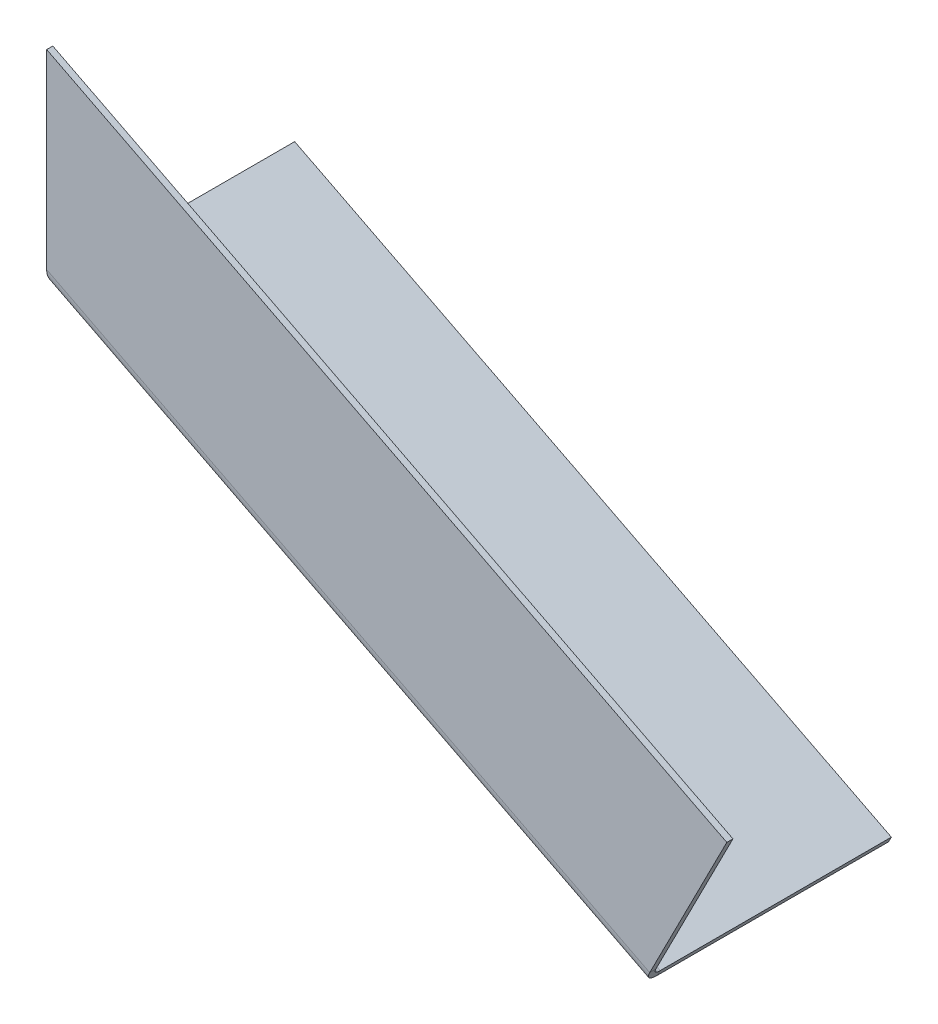
ISO-10303-21;
HEADER;
FILE_DESCRIPTION(('STEP AP214'),'2;1');
FILE_NAME('part.step','',(''),(''),'','','');
FILE_SCHEMA(('AUTOMOTIVE_DESIGN { 1 0 10303 214 1 1 1 1 }'));
ENDSEC;
DATA;
#1=APPLICATION_CONTEXT('core data for automotive mechanical design processes');
#2=APPLICATION_PROTOCOL_DEFINITION('international standard','automotive_design',2000,#1);
#3=PRODUCT_CONTEXT('',#1,'mechanical');
#4=PRODUCT('Part','Part','',(#3));
#5=PRODUCT_RELATED_PRODUCT_CATEGORY('part','',(#4));
#6=PRODUCT_DEFINITION_FORMATION('','',#4);
#7=PRODUCT_DEFINITION_CONTEXT('part definition',#1,'design');
#8=PRODUCT_DEFINITION('design','',#6,#7);
#9=PRODUCT_DEFINITION_SHAPE('','',#8);
#10=(LENGTH_UNIT() NAMED_UNIT(*) SI_UNIT(.MILLI.,.METRE.));
#11=(NAMED_UNIT(*) PLANE_ANGLE_UNIT() SI_UNIT($,.RADIAN.));
#12=(NAMED_UNIT(*) SI_UNIT($,.STERADIAN.) SOLID_ANGLE_UNIT());
#13=UNCERTAINTY_MEASURE_WITH_UNIT(LENGTH_MEASURE(1.E-05),#10,'distance_accuracy_value','');
#14=(GEOMETRIC_REPRESENTATION_CONTEXT(3) GLOBAL_UNCERTAINTY_ASSIGNED_CONTEXT((#13)) GLOBAL_UNIT_ASSIGNED_CONTEXT((#10,
#11,#12)) REPRESENTATION_CONTEXT('',''));
#15=CARTESIAN_POINT('',(0.,0.,0.));
#16=DIRECTION('',(0.,0.,1.));
#17=DIRECTION('',(1.,0.,0.));
#18=AXIS2_PLACEMENT_3D('',#15,#16,#17);
#19=CARTESIAN_POINT('',(-0.00293144740752917,-31.9798217250515,39.9296640146386));
#20=CARTESIAN_POINT('',(-0.0071534650994764,-32.3573127301977,39.8698220839962));
#21=CARTESIAN_POINT('',(-0.0130730410045433,-32.7261659165773,39.7724728086325));
#22=CARTESIAN_POINT('',(-0.0239778487713968,-33.4431791943966,39.4999996285628));
#23=CARTESIAN_POINT('',(-0.0286594285825225,-33.7931858406784,39.3239775521161));
#24=CARTESIAN_POINT('',(-0.0321544801784738,-34.2921472334461,38.9956954327784));
#25=CARTESIAN_POINT('',(-0.0327328344029795,-34.4528182206478,38.8764184467605));
#26=CARTESIAN_POINT('',(-0.0322522901227189,-34.7619126095619,38.6169162821423));
#27=CARTESIAN_POINT('',(-0.0312345487248001,-34.910988793869,38.4759094920383));
#28=CARTESIAN_POINT('',(-0.0268555426421286,-35.3298746803564,38.0255094120973));
#29=CARTESIAN_POINT('',(-0.0212717875252789,-35.5748568140411,37.6889598912189));
#30=CARTESIAN_POINT('',(-0.0206939389701947,-35.7731444830034,37.2999864592261));
#31=CARTESIAN_POINT('',(0.155242558766089,-31.6693877588373,37.9602448778392));
#32=CARTESIAN_POINT('',(0.217791935777052,-31.9158471511565,37.9264198378169));
#33=CARTESIAN_POINT('',(0.277271758439338,-32.1563321629699,37.8713976744445));
#34=CARTESIAN_POINT('',(0.393447613613939,-32.6239355966537,37.7173910944052));
#35=CARTESIAN_POINT('',(0.450742368852166,-32.852306836675,37.617900355544));
#36=CARTESIAN_POINT('',(0.535314482060101,-33.1784266866085,37.43234959244));
#37=CARTESIAN_POINT('',(0.563045685507329,-33.2835370385175,37.3649321655604));
#38=CARTESIAN_POINT('',(0.617844605017635,-33.4860256135632,37.218257029037));
#39=CARTESIAN_POINT('',(0.644989659143247,-33.5838240594303,37.1385575389782));
#40=CARTESIAN_POINT('',(0.722647080439956,-33.8588929583919,36.8839835807508));
#41=CARTESIAN_POINT('',(0.770789035060009,-34.0201964899942,36.693929091892));
#42=CARTESIAN_POINT('',(0.806215836183954,-34.1502426711809,36.4739053899975));
#43=B_SPLINE_SURFACE_WITH_KNOTS('',1,3,((#19,#20,#21,#22,#23,#24,#25,#26,#27,#28,#29,#30),(#31,
#32,#33,#34,#35,#36,#37,#38,#39,#40,#41,#42)),.UNSPECIFIED.,.F.,.F.,.F.,(2,2),(4,2,2,2,2,4),(0.,
1.),(0.,0.000758718306355654,0.00151743661271129,0.00189679576588911,0.00227615491906693,
0.00303487322542257),.UNSPECIFIED.);
#44=CARTESIAN_POINT('',(-0.0206939389700522,-35.7731444830034,37.2999864592262));
#45=CARTESIAN_POINT('',(0.806215836184088,-34.150242671181,36.4739053899975));
#46=B_SPLINE_CURVE_WITH_KNOTS('',1,(#44,#45),.UNSPECIFIED.,.F.,.F.,(2,2),(0.,1.),.UNSPECIFIED.);
#47=CARTESIAN_POINT('',(-0.0206939389701542,-35.7731444830034,37.2999864592261));
#48=VERTEX_POINT('',#47);
#49=CARTESIAN_POINT('',(0.806215836183954,-34.1502426711811,36.4739053899975));
#50=VERTEX_POINT('',#49);
#51=EDGE_CURVE('E11',#48,#50,#46,.T.);
#52=CARTESIAN_POINT('',(-0.0206939389701947,-35.7731444830034,37.2999864592261));
#53=CARTESIAN_POINT('',(-0.0212717875252789,-35.5748568140411,37.6889598912189));
#54=CARTESIAN_POINT('',(-0.0268555426421286,-35.3298746803564,38.0255094120973));
#55=CARTESIAN_POINT('',(-0.0312345487248001,-34.910988793869,38.4759094920383));
#56=CARTESIAN_POINT('',(-0.0322522901227189,-34.7619126095619,38.6169162821423));
#57=CARTESIAN_POINT('',(-0.0327328344029795,-34.4528182206478,38.8764184467605));
#58=CARTESIAN_POINT('',(-0.0321544801784738,-34.2921472334461,38.9956954327784));
#59=CARTESIAN_POINT('',(-0.0286594285825225,-33.7931858406784,39.3239775521161));
#60=CARTESIAN_POINT('',(-0.0239778487713968,-33.4431791943966,39.4999996285628));
#61=CARTESIAN_POINT('',(-0.0130730410045433,-32.7261659165773,39.7724728086325));
#62=CARTESIAN_POINT('',(-0.0071534650994764,-32.3573127301977,39.8698220839962));
#63=CARTESIAN_POINT('',(-0.00293144740752917,-31.9798217250515,39.9296640146386));
#64=B_SPLINE_CURVE_WITH_KNOTS('',3,(#52,#53,#54,#55,#56,#57,#58,#59,#60,#61,#62,#63),
.UNSPECIFIED.,.F.,.F.,(4,2,2,2,2,4),(0.,0.000758718306355655,0.00113807745953347,
0.00151743661271129,0.00227615491906693,0.00303487322542257),.UNSPECIFIED.);
#65=CARTESIAN_POINT('',(-0.00293144740757867,-31.9798217250515,39.9296640146387));
#66=VERTEX_POINT('',#65);
#67=EDGE_CURVE('E132',#66,#48,#64,.F.);
#68=CARTESIAN_POINT('',(-0.00293144740752917,-31.9798217250515,39.9296640146386));
#69=CARTESIAN_POINT('',(0.155242558766089,-31.6693877588373,37.9602448778392));
#70=B_SPLINE_CURVE_WITH_KNOTS('',1,(#68,#69),.UNSPECIFIED.,.F.,.F.,(2,2),(0.,1.),.UNSPECIFIED.);
#71=CARTESIAN_POINT('',(0.155241708459652,-31.6693879608942,37.9602447776971));
#72=VERTEX_POINT('',#71);
#73=EDGE_CURVE('E59',#66,#72,#70,.T.);
#74=CARTESIAN_POINT('',(0.155242558766089,-31.6693877588373,37.9602448778392));
#75=CARTESIAN_POINT('',(0.217791935777052,-31.9158471511565,37.9264198378169));
#76=CARTESIAN_POINT('',(0.277271758439338,-32.1563321629699,37.8713976744445));
#77=CARTESIAN_POINT('',(0.393447613613939,-32.6239355966537,37.7173910944052));
#78=CARTESIAN_POINT('',(0.450742368852166,-32.852306836675,37.617900355544));
#79=CARTESIAN_POINT('',(0.535314482060101,-33.1784266866085,37.43234959244));
#80=CARTESIAN_POINT('',(0.563045685507329,-33.2835370385175,37.3649321655604));
#81=CARTESIAN_POINT('',(0.617844605017635,-33.4860256135632,37.218257029037));
#82=CARTESIAN_POINT('',(0.644989659143247,-33.5838240594303,37.1385575389782));
#83=CARTESIAN_POINT('',(0.722647080439956,-33.8588929583919,36.8839835807508));
#84=CARTESIAN_POINT('',(0.770789035060009,-34.0201964899942,36.693929091892));
#85=CARTESIAN_POINT('',(0.806215836183954,-34.1502426711809,36.4739053899975));
#86=B_SPLINE_CURVE_WITH_KNOTS('',3,(#74,#75,#76,#77,#78,#79,#80,#81,#82,#83,#84,#85),
.UNSPECIFIED.,.F.,.F.,(4,2,2,2,2,4),(0.,0.000758718306355654,0.00151743661271129,
0.00189679576588911,0.00227615491906693,0.00303487322542257),.UNSPECIFIED.);
#87=EDGE_CURVE('E261',#72,#50,#86,.T.);
#88=ORIENTED_EDGE('',*,*,#51,.F.);
#89=ORIENTED_EDGE('',*,*,#67,.F.);
#90=ORIENTED_EDGE('',*,*,#73,.T.);
#91=ORIENTED_EDGE('',*,*,#87,.T.);
#92=EDGE_LOOP('',(#88,#89,#90,#91));
#93=FACE_BOUND('',#92,.T.);
#94=ADVANCED_FACE('F45',(#93),#43,.T.);
#95=CARTESIAN_POINT('',(0.,-31.0819517821508,40.0000000000002));
#96=CARTESIAN_POINT('',(-0.00159941509093738,-31.382469139948,40.0000000000002));
#97=CARTESIAN_POINT('',(-0.00319685827762162,-31.6829628275133,39.9764357865138));
#98=CARTESIAN_POINT('',(-0.00293249539698418,-31.9798223150835,39.9296638374642));
#99=CARTESIAN_POINT('',(0.,-31.0819517821508,38.0000000000002));
#100=CARTESIAN_POINT('',(0.0513965444831389,-31.2784567784155,38.0000000000002));
#101=CARTESIAN_POINT('',(0.102791731106516,-31.4749504430474,37.9866809247502));
#102=CARTESIAN_POINT('',(0.155241708459797,-31.6693879608942,37.9602447776973));
#103=B_SPLINE_SURFACE_WITH_KNOTS('',1,3,((#95,#96,#97,#98),(#99,#100,#101,#102)),.UNSPECIFIED.,
.F.,.F.,.F.,(2,2),(4,4),(0.,1.),(0.,1.),.UNSPECIFIED.);
#104=CARTESIAN_POINT('',(-0.00293249539698418,-31.9798223150835,39.9296638374642));
#105=CARTESIAN_POINT('',(-0.00319685827762162,-31.6829628275133,39.9764357865138));
#106=CARTESIAN_POINT('',(-0.00159941509093738,-31.382469139948,40.0000000000002));
#107=CARTESIAN_POINT('',(0.,-31.0819517821508,40.0000000000002));
#108=B_SPLINE_CURVE_WITH_KNOTS('',3,(#104,#105,#106,#107),.UNSPECIFIED.,.F.,.F.,(4,4),(0.,1.),.UNSPECIFIED.);
#109=CARTESIAN_POINT('',(-1.14048567911002E-13,-31.0819517821509,40.0000000000002));
#110=VERTEX_POINT('',#109);
#111=EDGE_CURVE('E301',#110,#66,#108,.F.);
#112=CARTESIAN_POINT('',(0.,-31.0819517821508,40.0000000000002));
#113=CARTESIAN_POINT('',(0.,-31.0819517821508,38.0000000000002));
#114=B_SPLINE_CURVE_WITH_KNOTS('',1,(#112,#113),.UNSPECIFIED.,.F.,.F.,(2,2),(0.,1.),.UNSPECIFIED.);
#115=CARTESIAN_POINT('',(-1.11022302462516E-13,-31.0819517821509,38.0000000000001));
#116=VERTEX_POINT('',#115);
#117=EDGE_CURVE('E207',#110,#116,#114,.T.);
#118=CARTESIAN_POINT('',(0.,-31.0819517821508,38.0000000000002));
#119=CARTESIAN_POINT('',(0.0513965444831389,-31.2784567784155,38.0000000000002));
#120=CARTESIAN_POINT('',(0.102791731106516,-31.4749504430474,37.9866809247502));
#121=CARTESIAN_POINT('',(0.155241708459797,-31.6693879608942,37.9602447776973));
#122=B_SPLINE_CURVE_WITH_KNOTS('',3,(#118,#119,#120,#121),.UNSPECIFIED.,.F.,.F.,(4,4),(0.,1.),.UNSPECIFIED.);
#123=EDGE_CURVE('E346',#116,#72,#122,.T.);
#124=ORIENTED_EDGE('',*,*,#73,.F.);
#125=ORIENTED_EDGE('',*,*,#111,.F.);
#126=ORIENTED_EDGE('',*,*,#117,.T.);
#127=ORIENTED_EDGE('',*,*,#123,.T.);
#128=EDGE_LOOP('',(#124,#125,#126,#127));
#129=FACE_BOUND('',#128,.T.);
#130=ADVANCED_FACE('F219',(#129),#103,.T.);
#131=CARTESIAN_POINT('',(-1.11022302462516E-13,-3.33066907387547E-13,38.0000000000001));
#132=DIRECTION('',(1.,0.,0.));
#133=DIRECTION('',(0.,-1.,0.));
#134=AXIS2_PLACEMENT_3D('',#131,#132,#133);
#135=PLANE('',#134);
#136=ORIENTED_EDGE('',*,*,#117,.F.);
#137=DIRECTION('',(0.,1.,0.));
#138=VECTOR('',#137,1.);
#139=CARTESIAN_POINT('',(-1.6955971914226E-13,-2.35809509567117E-13,40.0000000000004));
#140=LINE('',#139,#138);
#141=CARTESIAN_POINT('',(-1.6955971914226E-13,31.0949217827926,40.0000000000006));
#142=VERTEX_POINT('',#141);
#143=EDGE_CURVE('E385',#142,#110,#140,.F.);
#144=ORIENTED_EDGE('',*,*,#143,.F.);
#145=DIRECTION('',(0.,0.,-1.));
#146=VECTOR('',#145,1.);
#147=CARTESIAN_POINT('',(-1.66533453693773E-13,31.0949217827926,38.0000000000006));
#148=LINE('',#147,#146);
#149=CARTESIAN_POINT('',(-1.66533453693773E-13,31.0949217827926,38.0000000000006));
#150=VERTEX_POINT('',#149);
#151=EDGE_CURVE('E204',#142,#150,#148,.T.);
#152=ORIENTED_EDGE('',*,*,#151,.T.);
#153=DIRECTION('',(0.,-1.,0.));
#154=VECTOR('',#153,1.);
#155=CARTESIAN_POINT('',(-1.11022302462516E-13,-3.33066907387547E-13,38.0000000000001));
#156=LINE('',#155,#154);
#157=EDGE_CURVE('E433',#150,#116,#156,.T.);
#158=ORIENTED_EDGE('',*,*,#157,.T.);
#159=EDGE_LOOP('',(#136,#144,#152,#158));
#160=FACE_BOUND('',#159,.T.);
#161=ADVANCED_FACE('F230',(#160),#135,.F.);
#162=CARTESIAN_POINT('',(-0.891006524188331,31.5489122825321,38.0000000000006));
#163=DIRECTION('',(0.453990499739545,0.891006524188369,0.));
#164=DIRECTION('',(0.891006524188369,-0.453990499739545,0.));
#165=AXIS2_PLACEMENT_3D('',#162,#163,#164);
#166=PLANE('',#165);
#167=ORIENTED_EDGE('',*,*,#151,.F.);
#168=DIRECTION('',(0.891006524188369,-0.453990499739545,0.));
#169=VECTOR('',#168,1.);
#170=CARTESIAN_POINT('',(-0.891006524188334,31.5489122825321,40.0000000000006));
#171=LINE('',#170,#169);
#172=CARTESIAN_POINT('',(221.860624522904,-81.9487126523542,40.0000000000002));
#173=VERTEX_POINT('',#172);
#174=EDGE_CURVE('E376',#173,#142,#171,.F.);
#175=ORIENTED_EDGE('',*,*,#174,.F.);
#176=DIRECTION('',(0.,0.,-1.));
#177=VECTOR('',#176,1.);
#178=CARTESIAN_POINT('',(221.860624522904,-81.9487126523541,38.0000000000002));
#179=LINE('',#178,#177);
#180=CARTESIAN_POINT('',(221.860624522904,-81.9487126523541,38.0000000000002));
#181=VERTEX_POINT('',#180);
#182=EDGE_CURVE('E201',#173,#181,#179,.T.);
#183=ORIENTED_EDGE('',*,*,#182,.T.);
#184=DIRECTION('',(0.891006524188369,-0.453990499739545,0.));
#185=VECTOR('',#184,1.);
#186=CARTESIAN_POINT('',(-0.891006524188331,31.5489122825321,38.0000000000006));
#187=LINE('',#186,#185);
#188=EDGE_CURVE('E426',#181,#150,#187,.F.);
#189=ORIENTED_EDGE('',*,*,#188,.T.);
#190=EDGE_LOOP('',(#167,#175,#183,#189));
#191=FACE_BOUND('',#190,.T.);
#192=ADVANCED_FACE('F424',(#191),#166,.T.);
#193=CARTESIAN_POINT('',(221.860624522904,-81.9487126523541,38.0000000000002));
#194=DIRECTION('',(0.891006524188369,-0.453990499739544,0.));
#195=DIRECTION('',(-0.453990499739544,-0.891006524188369,0.));
#196=AXIS2_PLACEMENT_3D('',#193,#194,#195);
#197=PLANE('',#196);
#198=ORIENTED_EDGE('',*,*,#182,.F.);
#199=DIRECTION('',(-0.453990499739544,-0.891006524188369,0.));
#200=VECTOR('',#199,1.);
#201=CARTESIAN_POINT('',(221.860624522904,-81.9487126523542,40.0000000000002));
#202=LINE('',#201,#200);
#203=CARTESIAN_POINT('',(196.709550837333,-131.31047409239,39.9999999999999));
#204=VERTEX_POINT('',#203);
#205=EDGE_CURVE('E369',#204,#173,#202,.F.);
#206=ORIENTED_EDGE('',*,*,#205,.F.);
#207=DIRECTION('',(0.,0.,-1.));
#208=VECTOR('',#207,1.);
#209=CARTESIAN_POINT('',(196.709550837333,-131.31047409239,38.));
#210=LINE('',#209,#208);
#211=CARTESIAN_POINT('',(196.709550837333,-131.31047409239,38.));
#212=VERTEX_POINT('',#211);
#213=EDGE_CURVE('E198',#204,#212,#210,.T.);
#214=ORIENTED_EDGE('',*,*,#213,.T.);
#215=DIRECTION('',(-0.453990499739544,-0.891006524188369,0.));
#216=VECTOR('',#215,1.);
#217=CARTESIAN_POINT('',(221.860624522904,-81.9487126523541,38.0000000000002));
#218=LINE('',#217,#216);
#219=EDGE_CURVE('E420',#212,#181,#218,.F.);
#220=ORIENTED_EDGE('',*,*,#219,.T.);
#221=EDGE_LOOP('',(#198,#206,#214,#220));
#222=FACE_BOUND('',#221,.T.);
#223=ADVANCED_FACE('F418',(#222),#197,.T.);
#224=CARTESIAN_POINT('',(196.709550837333,-131.31047409239,35.3999999999999));
#225=DIRECTION('',(-0.891006524188369,0.453990499739546,0.));
#226=DIRECTION('',(-0.453990499739546,-0.891006524188369,0.));
#227=AXIS2_PLACEMENT_3D('',#224,#225,#226);
#228=PLANE('',#227);
#229=ORIENTED_EDGE('',*,*,#213,.F.);
#230=CARTESIAN_POINT('',(196.709550837333,-131.31047409239,35.3999999999999));
#231=DIRECTION('',(0.891006524188369,-0.453990499739546,0.));
#232=DIRECTION('',(0.453990499739546,0.891006524188369,0.));
#233=AXIS2_PLACEMENT_3D('',#230,#231,#232);
#234=CIRCLE('',#233,4.60000000000005);
#235=CARTESIAN_POINT('',(194.621194538531,-135.409104103656,35.3999999999998));
#236=VERTEX_POINT('',#235);
#237=EDGE_CURVE('E388',#204,#236,#234,.T.);
#238=ORIENTED_EDGE('',*,*,#237,.T.);
#239=DIRECTION('',(0.453990499739545,0.891006524188369,0.));
#240=VECTOR('',#239,1.);
#241=CARTESIAN_POINT('',(195.52917553801,-133.62709105528,35.3999999999998));
#242=LINE('',#241,#240);
#243=CARTESIAN_POINT('',(195.52917553801,-133.62709105528,35.3999999999998));
#244=VERTEX_POINT('',#243);
#245=EDGE_CURVE('E195',#236,#244,#242,.T.);
#246=ORIENTED_EDGE('',*,*,#245,.T.);
#247=CARTESIAN_POINT('',(196.709550837333,-131.31047409239,35.3999999999999));
#248=DIRECTION('',(0.891006524188369,-0.453990499739546,0.));
#249=DIRECTION('',(0.453990499739546,0.891006524188369,0.));
#250=AXIS2_PLACEMENT_3D('',#247,#248,#249);
#251=CIRCLE('',#250,2.60000000000005);
#252=EDGE_CURVE('E121',#212,#244,#251,.T.);
#253=ORIENTED_EDGE('',*,*,#252,.F.);
#254=EDGE_LOOP('',(#229,#238,#246,#253));
#255=FACE_BOUND('',#254,.T.);
#256=ADVANCED_FACE('F410',(#255),#228,.F.);
#257=CARTESIAN_POINT('',(195.52917553801,-133.627091055279,-40.0000000000002));
#258=DIRECTION('',(0.891006524188369,-0.453990499739545,0.));
#259=DIRECTION('',(0.,0.,1.));
#260=AXIS2_PLACEMENT_3D('',#257,#258,#259);
#261=PLANE('',#260);
#262=ORIENTED_EDGE('',*,*,#245,.F.);
#263=DIRECTION('',(0.,0.,1.));
#264=VECTOR('',#263,1.);
#265=CARTESIAN_POINT('',(194.621194538531,-135.409104103656,-1.10884268271544E-13));
#266=LINE('',#265,#264);
#267=CARTESIAN_POINT('',(194.621194538531,-135.409104103656,-40.0000000000002));
#268=VERTEX_POINT('',#267);
#269=EDGE_CURVE('E363',#268,#236,#266,.T.);
#270=ORIENTED_EDGE('',*,*,#269,.F.);
#271=DIRECTION('',(0.453990499739545,0.891006524188369,0.));
#272=VECTOR('',#271,1.);
#273=CARTESIAN_POINT('',(195.52917553801,-133.627091055279,-40.0000000000002));
#274=LINE('',#273,#272);
#275=CARTESIAN_POINT('',(195.52917553801,-133.627091055279,-40.0000000000002));
#276=VERTEX_POINT('',#275);
#277=EDGE_CURVE('E192',#268,#276,#274,.T.);
#278=ORIENTED_EDGE('',*,*,#277,.T.);
#279=DIRECTION('',(0.,0.,1.));
#280=VECTOR('',#279,1.);
#281=CARTESIAN_POINT('',(195.52917553801,-133.627091055279,-40.0000000000002));
#282=LINE('',#281,#280);
#283=EDGE_CURVE('E333',#276,#244,#282,.T.);
#284=ORIENTED_EDGE('',*,*,#283,.T.);
#285=EDGE_LOOP('',(#262,#270,#278,#284));
#286=FACE_BOUND('',#285,.T.);
#287=ADVANCED_FACE('F403',(#286),#261,.T.);
#288=CARTESIAN_POINT('',(195.52917553801,-133.627091055279,-40.0000000000002));
#289=DIRECTION('',(0.,0.,-1.));
#290=DIRECTION('',(0.891006524188369,-0.453990499739545,0.));
#291=AXIS2_PLACEMENT_3D('',#288,#289,#290);
#292=PLANE('',#291);
#293=ORIENTED_EDGE('',*,*,#277,.F.);
#294=DIRECTION('',(0.891006524188369,-0.453990499739545,0.));
#295=VECTOR('',#294,1.);
#296=CARTESIAN_POINT('',(-14.6612699038531,-28.7743623373488,-39.9999999999998));
#297=LINE('',#296,#295);
#298=CARTESIAN_POINT('',(0.,-36.2446524752687,-39.9999999999998));
#299=VERTEX_POINT('',#298);
#300=EDGE_CURVE('E143',#299,#268,#297,.T.);
#301=ORIENTED_EDGE('',*,*,#300,.F.);
#302=DIRECTION('',(0.453990499739545,0.891006524188369,0.));
#303=VECTOR('',#302,1.);
#304=CARTESIAN_POINT('',(0.907980999479197,-34.462639426892,-39.9999999999998));
#305=LINE('',#304,#303);
#306=CARTESIAN_POINT('',(0.907980999479197,-34.462639426892,-39.9999999999998));
#307=VERTEX_POINT('',#306);
#308=EDGE_CURVE('E184',#299,#307,#305,.T.);
#309=ORIENTED_EDGE('',*,*,#308,.T.);
#310=DIRECTION('',(0.891006524188369,-0.453990499739545,0.));
#311=VECTOR('',#310,1.);
#312=CARTESIAN_POINT('',(195.52917553801,-133.627091055279,-40.0000000000002));
#313=LINE('',#312,#311);
#314=EDGE_CURVE('E328',#307,#276,#313,.T.);
#315=ORIENTED_EDGE('',*,*,#314,.T.);
#316=EDGE_LOOP('',(#293,#301,#309,#315));
#317=FACE_BOUND('',#316,.T.);
#318=ADVANCED_FACE('F464',(#317),#292,.T.);
#319=CARTESIAN_POINT('',(0.90798099947903,-34.4626394268921,-1.04083408558608E-13));
#320=DIRECTION('',(0.891006524188369,-0.453990499739545,0.));
#321=DIRECTION('',(0.,0.,1.));
#322=AXIS2_PLACEMENT_3D('',#319,#320,#321);
#323=PLANE('',#322);
#324=ORIENTED_EDGE('',*,*,#308,.F.);
#325=DIRECTION('',(0.,0.,1.));
#326=VECTOR('',#325,1.);
#327=CARTESIAN_POINT('',(0.,-36.2446524752689,-1.10884268271544E-13));
#328=LINE('',#327,#326);
#329=CARTESIAN_POINT('',(-1.03221462212645E-13,-36.2446524752689,35.4000000000001));
#330=VERTEX_POINT('',#329);
#331=EDGE_CURVE('E364',#299,#330,#328,.T.);
#332=ORIENTED_EDGE('',*,*,#331,.T.);
#333=CARTESIAN_POINT('',(0.907980999479071,-34.4626394268921,35.4000000000001));
#334=CARTESIAN_POINT('',(0.,-36.2446524752689,35.4));
#335=B_SPLINE_CURVE_WITH_KNOTS('',1,(#333,#334),.UNSPECIFIED.,.F.,.F.,(2,2),(0.,1.),.UNSPECIFIED.);
#336=CARTESIAN_POINT('',(0.907980999478974,-34.4626394268922,35.4000000000001));
#337=VERTEX_POINT('',#336);
#338=EDGE_CURVE('E120',#330,#337,#335,.F.);
#339=ORIENTED_EDGE('',*,*,#338,.T.);
#340=DIRECTION('',(0.,0.,1.));
#341=VECTOR('',#340,1.);
#342=CARTESIAN_POINT('',(0.90798099947903,-34.4626394268921,-1.04083408558608E-13));
#343=LINE('',#342,#341);
#344=EDGE_CURVE('E439',#307,#337,#343,.T.);
#345=ORIENTED_EDGE('',*,*,#344,.F.);
#346=EDGE_LOOP('',(#324,#332,#339,#345));
#347=FACE_BOUND('',#346,.T.);
#348=ADVANCED_FACE('F166',(#347),#323,.F.);
#349=CARTESIAN_POINT('',(-0.0222309950151929,-36.1137238445205,36.3844020143303));
#350=CARTESIAN_POINT('',(-0.0308226703680739,-36.1887760126189,36.0613514435326));
#351=CARTESIAN_POINT('',(-0.023538372019265,-36.2326590756854,35.7307119887811));
#352=CARTESIAN_POINT('',(0.,-36.2446524752689,35.4));
#353=CARTESIAN_POINT('',(0.864715321132547,-34.3729936866298,35.9564011385346));
#354=CARTESIAN_POINT('',(0.870093227462421,-34.4206289622596,35.7738074779142));
#355=CARTESIAN_POINT('',(0.884442645541568,-34.4506460365218,35.5869240239802));
#356=CARTESIAN_POINT('',(0.907980999479071,-34.4626394268921,35.4000000000001));
#357=B_SPLINE_SURFACE_WITH_KNOTS('',1,3,((#349,#350,#351,#352),(#353,#354,#355,#356)),
.UNSPECIFIED.,.F.,.F.,.F.,(2,2),(4,4),(0.,1.),(3.2031879090112E-06,1.),.UNSPECIFIED.);
#358=CARTESIAN_POINT('',(0.,-36.2446524752689,35.4));
#359=CARTESIAN_POINT('',(-0.023538372019265,-36.2326590756854,35.7307119887811));
#360=CARTESIAN_POINT('',(-0.0308226703680739,-36.1887760126189,36.0613514435326));
#361=CARTESIAN_POINT('',(-0.0222309950151929,-36.1137238445205,36.3844020143303));
#362=B_SPLINE_CURVE_WITH_KNOTS('',3,(#358,#359,#360,#361),.UNSPECIFIED.,.F.,.F.,(4,4),
(3.20318790891783E-06,1.),.UNSPECIFIED.);
#363=CARTESIAN_POINT('',(-0.0222310775721646,-36.1137245656961,36.3843989101362));
#364=VERTEX_POINT('',#363);
#365=EDGE_CURVE('E128',#364,#330,#362,.F.);
#366=CARTESIAN_POINT('',(-0.0222309950151929,-36.1137238445205,36.3844020143303));
#367=CARTESIAN_POINT('',(0.864715321132547,-34.3729936866298,35.9564011385346));
#368=B_SPLINE_CURVE_WITH_KNOTS('',1,(#366,#367),.UNSPECIFIED.,.F.,.F.,(2,2),(0.,1.),.UNSPECIFIED.);
#369=CARTESIAN_POINT('',(0.864715321132636,-34.3729936866293,35.9564011385345));
#370=VERTEX_POINT('',#369);
#371=EDGE_CURVE('E108',#364,#370,#368,.T.);
#372=CARTESIAN_POINT('',(0.864715321132547,-34.3729936866298,35.9564011385346));
#373=CARTESIAN_POINT('',(0.870093227462421,-34.4206289622596,35.7738074779142));
#374=CARTESIAN_POINT('',(0.884442645541568,-34.4506460365218,35.5869240239802));
#375=CARTESIAN_POINT('',(0.907980999479071,-34.4626394268921,35.4000000000001));
#376=B_SPLINE_CURVE_WITH_KNOTS('',3,(#372,#373,#374,#375),.UNSPECIFIED.,.F.,.F.,(4,4),
(3.2031879090112E-06,1.),.UNSPECIFIED.);
#377=EDGE_CURVE('E320',#370,#337,#376,.T.);
#378=ORIENTED_EDGE('',*,*,#338,.F.);
#379=ORIENTED_EDGE('',*,*,#365,.F.);
#380=ORIENTED_EDGE('',*,*,#371,.T.);
#381=ORIENTED_EDGE('',*,*,#377,.T.);
#382=EDGE_LOOP('',(#378,#379,#380,#381));
#383=FACE_BOUND('',#382,.T.);
#384=ADVANCED_FACE('F138',(#383),#357,.T.);
#385=CARTESIAN_POINT('',(-0.0206939389700522,-35.7731444830034,37.2999864592262));
#386=CARTESIAN_POINT('',(-0.0355942749167281,-35.9149149174726,37.0065519072921));
#387=CARTESIAN_POINT('',(-0.0364455066171112,-36.0290939566208,36.6991439971033));
#388=CARTESIAN_POINT('',(-0.0222309124555919,-36.1137231233926,36.384405118326));
#389=CARTESIAN_POINT('',(0.806215836184088,-34.150242671181,36.4739053899975));
#390=CARTESIAN_POINT('',(0.817584347010454,-34.2404573029874,36.3080515025476));
#391=CARTESIAN_POINT('',(0.836890535917244,-34.315075752725,36.1342983256376));
#392=CARTESIAN_POINT('',(0.864715269466694,-34.3729932289342,35.9564028929669));
#393=B_SPLINE_SURFACE_WITH_KNOTS('',1,3,((#385,#386,#387,#388),(#389,#390,#391,#392)),
.UNSPECIFIED.,.F.,.F.,.F.,(2,2),(4,4),(0.,1.),(0.,1.),.UNSPECIFIED.);
#394=CARTESIAN_POINT('',(-0.0222309124555919,-36.1137231233926,36.384405118326));
#395=CARTESIAN_POINT('',(-0.0364455066171112,-36.0290939566208,36.6991439971033));
#396=CARTESIAN_POINT('',(-0.0355942749167281,-35.9149149174726,37.0065519072921));
#397=CARTESIAN_POINT('',(-0.0206939389700522,-35.7731444830034,37.2999864592262));
#398=B_SPLINE_CURVE_WITH_KNOTS('',3,(#394,#395,#396,#397),.UNSPECIFIED.,.F.,.F.,(4,4),(0.,1.),.UNSPECIFIED.);
#399=EDGE_CURVE('E110',#48,#364,#398,.F.);
#400=CARTESIAN_POINT('',(0.806215836184088,-34.150242671181,36.4739053899975));
#401=CARTESIAN_POINT('',(0.817584347010454,-34.2404573029874,36.3080515025476));
#402=CARTESIAN_POINT('',(0.836890535917244,-34.315075752725,36.1342983256376));
#403=CARTESIAN_POINT('',(0.864715269466694,-34.3729932289342,35.9564028929669));
#404=B_SPLINE_CURVE_WITH_KNOTS('',3,(#400,#401,#402,#403),.UNSPECIFIED.,.F.,.F.,(4,4),(0.,1.),.UNSPECIFIED.);
#405=EDGE_CURVE('E113',#50,#370,#404,.T.);
#406=ORIENTED_EDGE('',*,*,#399,.F.);
#407=ORIENTED_EDGE('',*,*,#51,.T.);
#408=ORIENTED_EDGE('',*,*,#405,.T.);
#409=ORIENTED_EDGE('',*,*,#371,.F.);
#410=EDGE_LOOP('',(#406,#407,#408,#409));
#411=FACE_BOUND('',#410,.T.);
#412=ADVANCED_FACE('F47',(#411),#393,.T.);
#413=CARTESIAN_POINT('',(196.709550837333,-131.31047409239,35.3999999999999));
#414=DIRECTION('',(0.891006524188369,-0.453990499739546,0.));
#415=DIRECTION('',(0.,0.,1.));
#416=AXIS2_PLACEMENT_3D('',#413,#414,#415);
#417=CYLINDRICAL_SURFACE('',#416,2.60000000000005);
#418=ORIENTED_EDGE('',*,*,#377,.F.);
#419=ORIENTED_EDGE('',*,*,#405,.F.);
#420=ORIENTED_EDGE('',*,*,#87,.F.);
#421=ORIENTED_EDGE('',*,*,#123,.F.);
#422=DIRECTION('',(0.891006524188369,-0.453990499739545,0.));
#423=VECTOR('',#422,1.);
#424=CARTESIAN_POINT('',(-26.0420802097591,-17.8128491575036,38.0000000000003));
#425=LINE('',#424,#423);
#426=EDGE_CURVE('E391',#116,#212,#425,.T.);
#427=ORIENTED_EDGE('',*,*,#426,.T.);
#428=ORIENTED_EDGE('',*,*,#252,.T.);
#429=DIRECTION('',(0.891006524188369,-0.453990499739546,0.));
#430=VECTOR('',#429,1.);
#431=CARTESIAN_POINT('',(195.52917553801,-133.62709105528,35.3999999999998));
#432=LINE('',#431,#430);
#433=EDGE_CURVE('E325',#244,#337,#432,.F.);
#434=ORIENTED_EDGE('',*,*,#433,.T.);
#435=EDGE_LOOP('',(#418,#419,#420,#421,#427,#428,#434));
#436=FACE_BOUND('',#435,.T.);
#437=ADVANCED_FACE('F267',(#436),#417,.F.);
#438=CARTESIAN_POINT('',(-13.7532889043741,-26.9923492889722,-1.04083408558608E-13));
#439=DIRECTION('',(-0.453990499739545,-0.891006524188369,0.));
#440=DIRECTION('',(0.891006524188369,-0.453990499739545,0.));
#441=AXIS2_PLACEMENT_3D('',#438,#439,#440);
#442=PLANE('',#441);
#443=ORIENTED_EDGE('',*,*,#344,.T.);
#444=ORIENTED_EDGE('',*,*,#433,.F.);
#445=ORIENTED_EDGE('',*,*,#283,.F.);
#446=ORIENTED_EDGE('',*,*,#314,.F.);
#447=EDGE_LOOP('',(#443,#444,#445,#446));
#448=FACE_BOUND('',#447,.T.);
#449=ADVANCED_FACE('F277',(#448),#442,.F.);
#450=CARTESIAN_POINT('',(0.,-2.22044604925031E-13,38.0000000000004));
#451=DIRECTION('',(0.,0.,-1.));
#452=DIRECTION('',(0.,1.,0.));
#453=AXIS2_PLACEMENT_3D('',#450,#451,#452);
#454=PLANE('',#453);
#455=ORIENTED_EDGE('',*,*,#426,.F.);
#456=ORIENTED_EDGE('',*,*,#157,.F.);
#457=ORIENTED_EDGE('',*,*,#188,.F.);
#458=ORIENTED_EDGE('',*,*,#219,.F.);
#459=EDGE_LOOP('',(#455,#456,#457,#458));
#460=FACE_BOUND('',#459,.T.);
#461=ADVANCED_FACE('F431',(#460),#454,.T.);
#462=CARTESIAN_POINT('',(196.709550837333,-131.31047409239,35.3999999999999));
#463=DIRECTION('',(0.891006524188369,-0.453990499739546,0.));
#464=DIRECTION('',(0.,0.,1.));
#465=AXIS2_PLACEMENT_3D('',#462,#463,#464);
#466=CYLINDRICAL_SURFACE('',#465,4.60000000000005);
#467=ORIENTED_EDGE('',*,*,#365,.T.);
#468=DIRECTION('',(0.891006524188369,-0.453990499739546,0.));
#469=VECTOR('',#468,1.);
#470=CARTESIAN_POINT('',(194.621194538531,-135.409104103656,35.3999999999998));
#471=LINE('',#470,#469);
#472=EDGE_CURVE('E360',#236,#330,#471,.F.);
#473=ORIENTED_EDGE('',*,*,#472,.F.);
#474=ORIENTED_EDGE('',*,*,#237,.F.);
#475=DIRECTION('',(0.891006524188369,-0.453990499739546,0.));
#476=VECTOR('',#475,1.);
#477=CARTESIAN_POINT('',(196.709550837333,-131.31047409239,39.9999999999999));
#478=LINE('',#477,#476);
#479=EDGE_CURVE('E153',#110,#204,#478,.T.);
#480=ORIENTED_EDGE('',*,*,#479,.F.);
#481=ORIENTED_EDGE('',*,*,#111,.T.);
#482=ORIENTED_EDGE('',*,*,#67,.T.);
#483=ORIENTED_EDGE('',*,*,#399,.T.);
#484=EDGE_LOOP('',(#467,#473,#474,#480,#481,#482,#483));
#485=FACE_BOUND('',#484,.T.);
#486=ADVANCED_FACE('F126',(#485),#466,.T.);
#487=CARTESIAN_POINT('',(-14.6612699038532,-28.7743623373489,-1.10884268271544E-13));
#488=DIRECTION('',(-0.453990499739545,-0.891006524188369,0.));
#489=DIRECTION('',(0.891006524188369,-0.453990499739545,0.));
#490=AXIS2_PLACEMENT_3D('',#487,#488,#489);
#491=PLANE('',#490);
#492=ORIENTED_EDGE('',*,*,#331,.F.);
#493=ORIENTED_EDGE('',*,*,#300,.T.);
#494=ORIENTED_EDGE('',*,*,#269,.T.);
#495=ORIENTED_EDGE('',*,*,#472,.T.);
#496=EDGE_LOOP('',(#492,#493,#494,#495));
#497=FACE_BOUND('',#496,.T.);
#498=ADVANCED_FACE('F401',(#497),#491,.T.);
#499=CARTESIAN_POINT('',(0.,-2.35809509567117E-13,40.0000000000004));
#500=DIRECTION('',(0.,0.,-1.));
#501=DIRECTION('',(0.,1.,0.));
#502=AXIS2_PLACEMENT_3D('',#499,#500,#501);
#503=PLANE('',#502);
#504=ORIENTED_EDGE('',*,*,#479,.T.);
#505=ORIENTED_EDGE('',*,*,#205,.T.);
#506=ORIENTED_EDGE('',*,*,#174,.T.);
#507=ORIENTED_EDGE('',*,*,#143,.T.);
#508=EDGE_LOOP('',(#504,#505,#506,#507));
#509=FACE_BOUND('',#508,.T.);
#510=ADVANCED_FACE('F167',(#509),#503,.F.);
#511=CLOSED_SHELL('',(#94,#130,#161,#192,#223,#256,#287,#318,#348,#384,#412,#437,#449,#461,#486,
#498,#510));
#512=MANIFOLD_SOLID_BREP('B2',#511);
#513=ADVANCED_BREP_SHAPE_REPRESENTATION('',(#18,#512),#14);
#514=SHAPE_DEFINITION_REPRESENTATION(#9,#513);
ENDSEC;
END-ISO-10303-21;
